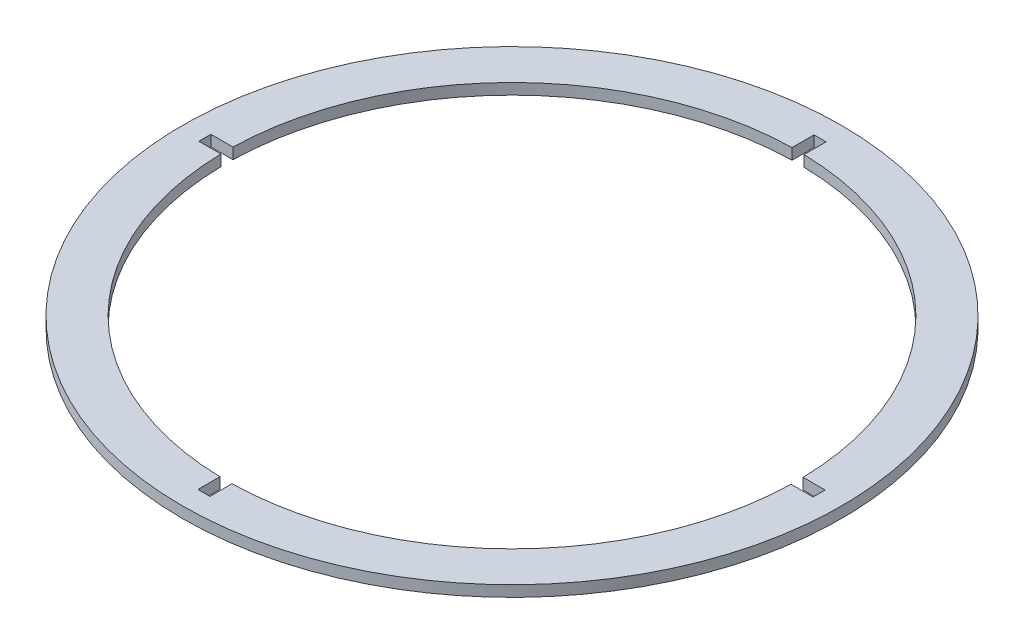
ISO-10303-21;
HEADER;
FILE_DESCRIPTION(('STEP AP214'),'2;1');
FILE_NAME('part.step','',(''),(''),'','','');
FILE_SCHEMA(('AUTOMOTIVE_DESIGN { 1 0 10303 214 1 1 1 1 }'));
ENDSEC;
DATA;
#1=APPLICATION_CONTEXT('core data for automotive mechanical design processes');
#2=APPLICATION_PROTOCOL_DEFINITION('international standard','automotive_design',2000,#1);
#3=PRODUCT_CONTEXT('',#1,'mechanical');
#4=PRODUCT('Part','Part','',(#3));
#5=PRODUCT_RELATED_PRODUCT_CATEGORY('part','',(#4));
#6=PRODUCT_DEFINITION_FORMATION('','',#4);
#7=PRODUCT_DEFINITION_CONTEXT('part definition',#1,'design');
#8=PRODUCT_DEFINITION('design','',#6,#7);
#9=PRODUCT_DEFINITION_SHAPE('','',#8);
#10=(LENGTH_UNIT() NAMED_UNIT(*) SI_UNIT(.MILLI.,.METRE.));
#11=(NAMED_UNIT(*) PLANE_ANGLE_UNIT() SI_UNIT($,.RADIAN.));
#12=(NAMED_UNIT(*) SI_UNIT($,.STERADIAN.) SOLID_ANGLE_UNIT());
#13=UNCERTAINTY_MEASURE_WITH_UNIT(LENGTH_MEASURE(1.E-05),#10,'distance_accuracy_value','');
#14=(GEOMETRIC_REPRESENTATION_CONTEXT(3) GLOBAL_UNCERTAINTY_ASSIGNED_CONTEXT((#13)) GLOBAL_UNIT_ASSIGNED_CONTEXT((#10,
#11,#12)) REPRESENTATION_CONTEXT('',''));
#15=CARTESIAN_POINT('',(0.,0.,0.));
#16=DIRECTION('',(0.,0.,1.));
#17=DIRECTION('',(1.,0.,0.));
#18=AXIS2_PLACEMENT_3D('',#15,#16,#17);
#19=CARTESIAN_POINT('',(0.,2.5,0.));
#20=DIRECTION('',(0.,1.,0.));
#21=DIRECTION('',(0.,0.,1.));
#22=AXIS2_PLACEMENT_3D('',#19,#20,#21);
#23=PLANE('',#22);
#24=CARTESIAN_POINT('',(0.,2.5,0.));
#25=DIRECTION('',(0.,1.,0.));
#26=DIRECTION('',(0.,0.,1.));
#27=AXIS2_PLACEMENT_3D('',#24,#25,#26);
#28=CIRCLE('',#27,150.);
#29=CARTESIAN_POINT('',(0.,2.5,150.));
#30=VERTEX_POINT('',#29);
#31=EDGE_CURVE('E11',#30,#30,#28,.T.);
#32=ORIENTED_EDGE('',*,*,#31,.T.);
#33=EDGE_LOOP('',(#32));
#34=FACE_BOUND('',#33,.T.);
#35=DIRECTION('',(0.,0.,-1.));
#36=VECTOR('',#35,1.);
#37=CARTESIAN_POINT('',(2.97500000000147,2.5,-140.));
#38=LINE('',#37,#36);
#39=CARTESIAN_POINT('',(2.97500000000136,2.5,-129.9659546766));
#40=VERTEX_POINT('',#39);
#41=CARTESIAN_POINT('',(2.97500000000147,2.5,-140.));
#42=VERTEX_POINT('',#41);
#43=EDGE_CURVE('E154',#40,#42,#38,.T.);
#44=ORIENTED_EDGE('',*,*,#43,.F.);
#45=CARTESIAN_POINT('',(0.,2.5,0.));
#46=DIRECTION('',(0.,1.,0.));
#47=DIRECTION('',(0.,0.,1.));
#48=AXIS2_PLACEMENT_3D('',#45,#46,#47);
#49=CIRCLE('',#48,130.);
#50=CARTESIAN_POINT('',(129.975476052215,2.5,-2.525));
#51=VERTEX_POINT('',#50);
#52=EDGE_CURVE('E146',#51,#40,#49,.T.);
#53=ORIENTED_EDGE('',*,*,#52,.F.);
#54=DIRECTION('',(-1.,0.,0.));
#55=VECTOR('',#54,1.);
#56=CARTESIAN_POINT('',(129.975476052215,2.5,-2.525));
#57=LINE('',#56,#55);
#58=CARTESIAN_POINT('',(140.,2.5,-2.525));
#59=VERTEX_POINT('',#58);
#60=EDGE_CURVE('E194',#59,#51,#57,.T.);
#61=ORIENTED_EDGE('',*,*,#60,.F.);
#62=DIRECTION('',(0.,0.,-1.));
#63=VECTOR('',#62,1.);
#64=CARTESIAN_POINT('',(140.,2.5,-2.525));
#65=LINE('',#64,#63);
#66=CARTESIAN_POINT('',(140.,2.5,2.975));
#67=VERTEX_POINT('',#66);
#68=EDGE_CURVE('E192',#67,#59,#65,.T.);
#69=ORIENTED_EDGE('',*,*,#68,.F.);
#70=DIRECTION('',(1.,0.,0.));
#71=VECTOR('',#70,1.);
#72=CARTESIAN_POINT('',(140.,2.5,2.975));
#73=LINE('',#72,#71);
#74=CARTESIAN_POINT('',(129.9659546766,2.5,2.975));
#75=VERTEX_POINT('',#74);
#76=EDGE_CURVE('E190',#75,#67,#73,.T.);
#77=ORIENTED_EDGE('',*,*,#76,.F.);
#78=CARTESIAN_POINT('',(0.,2.5,0.));
#79=DIRECTION('',(0.,1.,0.));
#80=DIRECTION('',(0.,0.,1.));
#81=AXIS2_PLACEMENT_3D('',#78,#79,#80);
#82=CIRCLE('',#81,130.);
#83=CARTESIAN_POINT('',(2.52499999999955,2.5,129.975476052215));
#84=VERTEX_POINT('',#83);
#85=EDGE_CURVE('E188',#84,#75,#82,.T.);
#86=ORIENTED_EDGE('',*,*,#85,.F.);
#87=DIRECTION('',(0.,0.,-1.));
#88=VECTOR('',#87,1.);
#89=CARTESIAN_POINT('',(2.52499999999955,2.5,129.975476052215));
#90=LINE('',#89,#88);
#91=CARTESIAN_POINT('',(2.52499999999951,2.5,140.));
#92=VERTEX_POINT('',#91);
#93=EDGE_CURVE('E186',#92,#84,#90,.T.);
#94=ORIENTED_EDGE('',*,*,#93,.F.);
#95=DIRECTION('',(1.,0.,0.));
#96=VECTOR('',#95,1.);
#97=CARTESIAN_POINT('',(2.52499999999951,2.5,140.));
#98=LINE('',#97,#96);
#99=CARTESIAN_POINT('',(-2.97500000000049,2.5,140.));
#100=VERTEX_POINT('',#99);
#101=EDGE_CURVE('E184',#100,#92,#98,.T.);
#102=ORIENTED_EDGE('',*,*,#101,.F.);
#103=DIRECTION('',(0.,0.,1.));
#104=VECTOR('',#103,1.);
#105=CARTESIAN_POINT('',(-2.97500000000049,2.5,140.));
#106=LINE('',#105,#104);
#107=CARTESIAN_POINT('',(-2.97500000000045,2.5,129.9659546766));
#108=VERTEX_POINT('',#107);
#109=EDGE_CURVE('E182',#108,#100,#106,.T.);
#110=ORIENTED_EDGE('',*,*,#109,.F.);
#111=CARTESIAN_POINT('',(0.,2.5,0.));
#112=DIRECTION('',(0.,1.,0.));
#113=DIRECTION('',(0.,0.,1.));
#114=AXIS2_PLACEMENT_3D('',#111,#112,#113);
#115=CIRCLE('',#114,130.);
#116=CARTESIAN_POINT('',(-129.975476052215,2.5,2.525));
#117=VERTEX_POINT('',#116);
#118=EDGE_CURVE('E180',#117,#108,#115,.T.);
#119=ORIENTED_EDGE('',*,*,#118,.F.);
#120=DIRECTION('',(1.,0.,0.));
#121=VECTOR('',#120,1.);
#122=CARTESIAN_POINT('',(-129.975476052215,2.5,2.52500000000002));
#123=LINE('',#122,#121);
#124=CARTESIAN_POINT('',(-140.,2.5,2.52499999999902));
#125=VERTEX_POINT('',#124);
#126=EDGE_CURVE('E178',#125,#117,#123,.T.);
#127=ORIENTED_EDGE('',*,*,#126,.F.);
#128=DIRECTION('',(0.,0.,1.));
#129=VECTOR('',#128,1.);
#130=CARTESIAN_POINT('',(-140.,2.5,2.52499999999902));
#131=LINE('',#130,#129);
#132=CARTESIAN_POINT('',(-140.,2.5,-2.97500000000098));
#133=VERTEX_POINT('',#132);
#134=EDGE_CURVE('E176',#133,#125,#131,.T.);
#135=ORIENTED_EDGE('',*,*,#134,.F.);
#136=DIRECTION('',(-1.,0.,0.));
#137=VECTOR('',#136,1.);
#138=CARTESIAN_POINT('',(-140.,2.5,-2.97500000000098));
#139=LINE('',#138,#137);
#140=CARTESIAN_POINT('',(-129.9659546766,2.5,-2.97500000000091));
#141=VERTEX_POINT('',#140);
#142=EDGE_CURVE('E174',#141,#133,#139,.T.);
#143=ORIENTED_EDGE('',*,*,#142,.F.);
#144=CARTESIAN_POINT('',(0.,2.5,0.));
#145=DIRECTION('',(0.,1.,0.));
#146=DIRECTION('',(0.,0.,1.));
#147=AXIS2_PLACEMENT_3D('',#144,#145,#146);
#148=CIRCLE('',#147,130.);
#149=CARTESIAN_POINT('',(-2.52499999999863,2.5,-129.975476052215));
#150=VERTEX_POINT('',#149);
#151=EDGE_CURVE('E172',#150,#141,#148,.T.);
#152=ORIENTED_EDGE('',*,*,#151,.F.);
#153=DIRECTION('',(0.,0.,1.));
#154=VECTOR('',#153,1.);
#155=CARTESIAN_POINT('',(-2.52499999999864,2.5,-129.975476052215));
#156=LINE('',#155,#154);
#157=CARTESIAN_POINT('',(-2.52499999999853,2.5,-140.));
#158=VERTEX_POINT('',#157);
#159=EDGE_CURVE('E168',#158,#150,#156,.T.);
#160=ORIENTED_EDGE('',*,*,#159,.F.);
#161=DIRECTION('',(-1.,0.,0.));
#162=VECTOR('',#161,1.);
#163=CARTESIAN_POINT('',(-2.52499999999853,2.5,-140.));
#164=LINE('',#163,#162);
#165=EDGE_CURVE('E166',#42,#158,#164,.T.);
#166=ORIENTED_EDGE('',*,*,#165,.F.);
#167=EDGE_LOOP('',(#44,#53,#61,#69,#77,#86,#94,#102,#110,#119,#127,#135,#143,#152,#160,#166));
#168=FACE_BOUND('',#167,.T.);
#169=ADVANCED_FACE('F33',(#34,#168),#23,.T.);
#170=CARTESIAN_POINT('',(0.,-2.5,0.));
#171=DIRECTION('',(0.,1.,0.));
#172=DIRECTION('',(0.,0.,1.));
#173=AXIS2_PLACEMENT_3D('',#170,#171,#172);
#174=PLANE('',#173);
#175=CARTESIAN_POINT('',(0.,-2.5,0.));
#176=DIRECTION('',(0.,1.,0.));
#177=DIRECTION('',(0.,0.,1.));
#178=AXIS2_PLACEMENT_3D('',#175,#176,#177);
#179=CIRCLE('',#178,150.);
#180=CARTESIAN_POINT('',(0.,-2.5,150.));
#181=VERTEX_POINT('',#180);
#182=EDGE_CURVE('E37',#181,#181,#179,.T.);
#183=ORIENTED_EDGE('',*,*,#182,.F.);
#184=EDGE_LOOP('',(#183));
#185=FACE_BOUND('',#184,.T.);
#186=CARTESIAN_POINT('',(0.,-2.5,0.));
#187=DIRECTION('',(0.,1.,0.));
#188=DIRECTION('',(0.,0.,1.));
#189=AXIS2_PLACEMENT_3D('',#186,#187,#188);
#190=CIRCLE('',#189,130.);
#191=CARTESIAN_POINT('',(129.975476052215,-2.5,-2.525));
#192=VERTEX_POINT('',#191);
#193=CARTESIAN_POINT('',(2.97500000000136,-2.5,-129.9659546766));
#194=VERTEX_POINT('',#193);
#195=EDGE_CURVE('E56',#192,#194,#190,.T.);
#196=ORIENTED_EDGE('',*,*,#195,.T.);
#197=DIRECTION('',(0.,0.,-1.));
#198=VECTOR('',#197,1.);
#199=CARTESIAN_POINT('',(2.97500000000147,-2.5,-140.));
#200=LINE('',#199,#198);
#201=CARTESIAN_POINT('',(2.97500000000147,-2.5,-140.));
#202=VERTEX_POINT('',#201);
#203=EDGE_CURVE('E161',#194,#202,#200,.T.);
#204=ORIENTED_EDGE('',*,*,#203,.T.);
#205=DIRECTION('',(-1.,0.,0.));
#206=VECTOR('',#205,1.);
#207=CARTESIAN_POINT('',(-2.52499999999853,-2.5,-140.));
#208=LINE('',#207,#206);
#209=CARTESIAN_POINT('',(-2.52499999999853,-2.5,-140.));
#210=VERTEX_POINT('',#209);
#211=EDGE_CURVE('E198',#202,#210,#208,.T.);
#212=ORIENTED_EDGE('',*,*,#211,.T.);
#213=DIRECTION('',(0.,0.,1.));
#214=VECTOR('',#213,1.);
#215=CARTESIAN_POINT('',(-2.52499999999864,-2.5,-129.975476052215));
#216=LINE('',#215,#214);
#217=CARTESIAN_POINT('',(-2.52499999999863,-2.5,-129.975476052215));
#218=VERTEX_POINT('',#217);
#219=EDGE_CURVE('E201',#210,#218,#216,.T.);
#220=ORIENTED_EDGE('',*,*,#219,.T.);
#221=CARTESIAN_POINT('',(0.,-2.5,0.));
#222=DIRECTION('',(0.,1.,0.));
#223=DIRECTION('',(0.,0.,1.));
#224=AXIS2_PLACEMENT_3D('',#221,#222,#223);
#225=CIRCLE('',#224,130.);
#226=CARTESIAN_POINT('',(-129.9659546766,-2.5,-2.97500000000091));
#227=VERTEX_POINT('',#226);
#228=EDGE_CURVE('E204',#218,#227,#225,.T.);
#229=ORIENTED_EDGE('',*,*,#228,.T.);
#230=DIRECTION('',(-1.,0.,0.));
#231=VECTOR('',#230,1.);
#232=CARTESIAN_POINT('',(-140.,-2.5,-2.97500000000098));
#233=LINE('',#232,#231);
#234=CARTESIAN_POINT('',(-140.,-2.5,-2.97500000000098));
#235=VERTEX_POINT('',#234);
#236=EDGE_CURVE('E207',#227,#235,#233,.T.);
#237=ORIENTED_EDGE('',*,*,#236,.T.);
#238=DIRECTION('',(0.,0.,1.));
#239=VECTOR('',#238,1.);
#240=CARTESIAN_POINT('',(-140.,-2.5,2.52499999999902));
#241=LINE('',#240,#239);
#242=CARTESIAN_POINT('',(-140.,-2.5,2.52499999999902));
#243=VERTEX_POINT('',#242);
#244=EDGE_CURVE('E210',#235,#243,#241,.T.);
#245=ORIENTED_EDGE('',*,*,#244,.T.);
#246=DIRECTION('',(1.,0.,0.));
#247=VECTOR('',#246,1.);
#248=CARTESIAN_POINT('',(-129.975476052215,-2.5,2.52500000000002));
#249=LINE('',#248,#247);
#250=CARTESIAN_POINT('',(-129.975476052215,-2.5,2.525));
#251=VERTEX_POINT('',#250);
#252=EDGE_CURVE('E213',#243,#251,#249,.T.);
#253=ORIENTED_EDGE('',*,*,#252,.T.);
#254=CARTESIAN_POINT('',(0.,-2.5,0.));
#255=DIRECTION('',(0.,1.,0.));
#256=DIRECTION('',(0.,0.,1.));
#257=AXIS2_PLACEMENT_3D('',#254,#255,#256);
#258=CIRCLE('',#257,130.);
#259=CARTESIAN_POINT('',(-2.97500000000045,-2.5,129.9659546766));
#260=VERTEX_POINT('',#259);
#261=EDGE_CURVE('E216',#251,#260,#258,.T.);
#262=ORIENTED_EDGE('',*,*,#261,.T.);
#263=DIRECTION('',(0.,0.,1.));
#264=VECTOR('',#263,1.);
#265=CARTESIAN_POINT('',(-2.97500000000049,-2.5,140.));
#266=LINE('',#265,#264);
#267=CARTESIAN_POINT('',(-2.97500000000049,-2.5,140.));
#268=VERTEX_POINT('',#267);
#269=EDGE_CURVE('E219',#260,#268,#266,.T.);
#270=ORIENTED_EDGE('',*,*,#269,.T.);
#271=DIRECTION('',(1.,0.,0.));
#272=VECTOR('',#271,1.);
#273=CARTESIAN_POINT('',(2.52499999999951,-2.5,140.));
#274=LINE('',#273,#272);
#275=CARTESIAN_POINT('',(2.52499999999951,-2.5,140.));
#276=VERTEX_POINT('',#275);
#277=EDGE_CURVE('E222',#268,#276,#274,.T.);
#278=ORIENTED_EDGE('',*,*,#277,.T.);
#279=DIRECTION('',(0.,0.,-1.));
#280=VECTOR('',#279,1.);
#281=CARTESIAN_POINT('',(2.52499999999955,-2.5,129.975476052215));
#282=LINE('',#281,#280);
#283=CARTESIAN_POINT('',(2.52499999999955,-2.5,129.975476052215));
#284=VERTEX_POINT('',#283);
#285=EDGE_CURVE('E225',#276,#284,#282,.T.);
#286=ORIENTED_EDGE('',*,*,#285,.T.);
#287=CARTESIAN_POINT('',(0.,-2.5,0.));
#288=DIRECTION('',(0.,1.,0.));
#289=DIRECTION('',(0.,0.,1.));
#290=AXIS2_PLACEMENT_3D('',#287,#288,#289);
#291=CIRCLE('',#290,130.);
#292=CARTESIAN_POINT('',(129.9659546766,-2.5,2.975));
#293=VERTEX_POINT('',#292);
#294=EDGE_CURVE('E228',#284,#293,#291,.T.);
#295=ORIENTED_EDGE('',*,*,#294,.T.);
#296=DIRECTION('',(1.,0.,0.));
#297=VECTOR('',#296,1.);
#298=CARTESIAN_POINT('',(140.,-2.5,2.975));
#299=LINE('',#298,#297);
#300=CARTESIAN_POINT('',(140.,-2.5,2.975));
#301=VERTEX_POINT('',#300);
#302=EDGE_CURVE('E231',#293,#301,#299,.T.);
#303=ORIENTED_EDGE('',*,*,#302,.T.);
#304=DIRECTION('',(0.,0.,-1.));
#305=VECTOR('',#304,1.);
#306=CARTESIAN_POINT('',(140.,-2.5,-2.525));
#307=LINE('',#306,#305);
#308=CARTESIAN_POINT('',(140.,-2.5,-2.525));
#309=VERTEX_POINT('',#308);
#310=EDGE_CURVE('E234',#301,#309,#307,.T.);
#311=ORIENTED_EDGE('',*,*,#310,.T.);
#312=DIRECTION('',(-1.,0.,0.));
#313=VECTOR('',#312,1.);
#314=CARTESIAN_POINT('',(129.975476052215,-2.5,-2.525));
#315=LINE('',#314,#313);
#316=EDGE_CURVE('E155',#309,#192,#315,.T.);
#317=ORIENTED_EDGE('',*,*,#316,.T.);
#318=EDGE_LOOP('',(#196,#204,#212,#220,#229,#237,#245,#253,#262,#270,#278,#286,#295,#303,#311,#317));
#319=FACE_BOUND('',#318,.T.);
#320=ADVANCED_FACE('F271',(#185,#319),#174,.F.);
#321=CARTESIAN_POINT('',(0.,2.5,0.));
#322=DIRECTION('',(0.,-1.,0.));
#323=DIRECTION('',(0.,0.,-1.));
#324=AXIS2_PLACEMENT_3D('',#321,#322,#323);
#325=CYLINDRICAL_SURFACE('',#324,150.);
#326=ORIENTED_EDGE('',*,*,#31,.F.);
#327=EDGE_LOOP('',(#326));
#328=FACE_BOUND('',#327,.T.);
#329=ORIENTED_EDGE('',*,*,#182,.T.);
#330=EDGE_LOOP('',(#329));
#331=FACE_BOUND('',#330,.T.);
#332=ADVANCED_FACE('F35',(#328,#331),#325,.T.);
#333=CARTESIAN_POINT('',(0.,2.5,0.));
#334=DIRECTION('',(0.,-1.,0.));
#335=DIRECTION('',(0.,0.,-1.));
#336=AXIS2_PLACEMENT_3D('',#333,#334,#335);
#337=CYLINDRICAL_SURFACE('',#336,130.);
#338=ORIENTED_EDGE('',*,*,#195,.F.);
#339=DIRECTION('',(0.,-1.,0.));
#340=VECTOR('',#339,1.);
#341=CARTESIAN_POINT('',(129.975476052215,2.5,-2.525));
#342=LINE('',#341,#340);
#343=EDGE_CURVE('E150',#51,#192,#342,.T.);
#344=ORIENTED_EDGE('',*,*,#343,.F.);
#345=ORIENTED_EDGE('',*,*,#52,.T.);
#346=DIRECTION('',(0.,-1.,0.));
#347=VECTOR('',#346,1.);
#348=CARTESIAN_POINT('',(2.97500000000136,2.5,-129.9659546766));
#349=LINE('',#348,#347);
#350=EDGE_CURVE('E149',#40,#194,#349,.T.);
#351=ORIENTED_EDGE('',*,*,#350,.T.);
#352=EDGE_LOOP('',(#338,#344,#345,#351));
#353=FACE_BOUND('',#352,.T.);
#354=ADVANCED_FACE('F148',(#353),#337,.F.);
#355=CARTESIAN_POINT('',(2.97500000000147,2.5,-140.));
#356=DIRECTION('',(-1.,0.,0.));
#357=DIRECTION('',(0.,0.,1.));
#358=AXIS2_PLACEMENT_3D('',#355,#356,#357);
#359=PLANE('',#358);
#360=ORIENTED_EDGE('',*,*,#203,.F.);
#361=ORIENTED_EDGE('',*,*,#350,.F.);
#362=ORIENTED_EDGE('',*,*,#43,.T.);
#363=DIRECTION('',(0.,-1.,0.));
#364=VECTOR('',#363,1.);
#365=CARTESIAN_POINT('',(2.97500000000147,2.5,-140.));
#366=LINE('',#365,#364);
#367=EDGE_CURVE('E162',#42,#202,#366,.T.);
#368=ORIENTED_EDGE('',*,*,#367,.T.);
#369=EDGE_LOOP('',(#360,#361,#362,#368));
#370=FACE_BOUND('',#369,.T.);
#371=ADVANCED_FACE('F158',(#370),#359,.T.);
#372=CARTESIAN_POINT('',(-2.52499999999853,2.5,-140.));
#373=DIRECTION('',(0.,0.,1.));
#374=DIRECTION('',(1.,0.,0.));
#375=AXIS2_PLACEMENT_3D('',#372,#373,#374);
#376=PLANE('',#375);
#377=ORIENTED_EDGE('',*,*,#211,.F.);
#378=ORIENTED_EDGE('',*,*,#367,.F.);
#379=ORIENTED_EDGE('',*,*,#165,.T.);
#380=DIRECTION('',(0.,-1.,0.));
#381=VECTOR('',#380,1.);
#382=CARTESIAN_POINT('',(-2.52499999999853,2.5,-140.));
#383=LINE('',#382,#381);
#384=EDGE_CURVE('E263',#158,#210,#383,.T.);
#385=ORIENTED_EDGE('',*,*,#384,.T.);
#386=EDGE_LOOP('',(#377,#378,#379,#385));
#387=FACE_BOUND('',#386,.T.);
#388=ADVANCED_FACE('F267',(#387),#376,.T.);
#389=CARTESIAN_POINT('',(-2.52499999999864,2.5,-129.975476052215));
#390=DIRECTION('',(1.,0.,0.));
#391=DIRECTION('',(0.,0.,-1.));
#392=AXIS2_PLACEMENT_3D('',#389,#390,#391);
#393=PLANE('',#392);
#394=ORIENTED_EDGE('',*,*,#219,.F.);
#395=ORIENTED_EDGE('',*,*,#384,.F.);
#396=ORIENTED_EDGE('',*,*,#159,.T.);
#397=DIRECTION('',(0.,-1.,0.));
#398=VECTOR('',#397,1.);
#399=CARTESIAN_POINT('',(-2.52499999999863,2.5,-129.975476052215));
#400=LINE('',#399,#398);
#401=EDGE_CURVE('E261',#150,#218,#400,.T.);
#402=ORIENTED_EDGE('',*,*,#401,.T.);
#403=EDGE_LOOP('',(#394,#395,#396,#402));
#404=FACE_BOUND('',#403,.T.);
#405=ADVANCED_FACE('F329',(#404),#393,.T.);
#406=CARTESIAN_POINT('',(0.,2.5,0.));
#407=DIRECTION('',(0.,-1.,0.));
#408=DIRECTION('',(0.,0.,-1.));
#409=AXIS2_PLACEMENT_3D('',#406,#407,#408);
#410=CYLINDRICAL_SURFACE('',#409,130.);
#411=ORIENTED_EDGE('',*,*,#228,.F.);
#412=ORIENTED_EDGE('',*,*,#401,.F.);
#413=ORIENTED_EDGE('',*,*,#151,.T.);
#414=DIRECTION('',(0.,-1.,0.));
#415=VECTOR('',#414,1.);
#416=CARTESIAN_POINT('',(-129.9659546766,2.5,-2.97500000000091));
#417=LINE('',#416,#415);
#418=EDGE_CURVE('E259',#141,#227,#417,.T.);
#419=ORIENTED_EDGE('',*,*,#418,.T.);
#420=EDGE_LOOP('',(#411,#412,#413,#419));
#421=FACE_BOUND('',#420,.T.);
#422=ADVANCED_FACE('F326',(#421),#410,.F.);
#423=CARTESIAN_POINT('',(-140.,2.5,-2.97500000000098));
#424=DIRECTION('',(0.,0.,1.));
#425=DIRECTION('',(1.,0.,0.));
#426=AXIS2_PLACEMENT_3D('',#423,#424,#425);
#427=PLANE('',#426);
#428=ORIENTED_EDGE('',*,*,#236,.F.);
#429=ORIENTED_EDGE('',*,*,#418,.F.);
#430=ORIENTED_EDGE('',*,*,#142,.T.);
#431=DIRECTION('',(0.,-1.,0.));
#432=VECTOR('',#431,1.);
#433=CARTESIAN_POINT('',(-140.,2.5,-2.97500000000098));
#434=LINE('',#433,#432);
#435=EDGE_CURVE('E257',#133,#235,#434,.T.);
#436=ORIENTED_EDGE('',*,*,#435,.T.);
#437=EDGE_LOOP('',(#428,#429,#430,#436));
#438=FACE_BOUND('',#437,.T.);
#439=ADVANCED_FACE('F323',(#438),#427,.T.);
#440=CARTESIAN_POINT('',(-140.,2.5,2.52499999999902));
#441=DIRECTION('',(1.,0.,0.));
#442=DIRECTION('',(0.,0.,-1.));
#443=AXIS2_PLACEMENT_3D('',#440,#441,#442);
#444=PLANE('',#443);
#445=ORIENTED_EDGE('',*,*,#244,.F.);
#446=ORIENTED_EDGE('',*,*,#435,.F.);
#447=ORIENTED_EDGE('',*,*,#134,.T.);
#448=DIRECTION('',(0.,-1.,0.));
#449=VECTOR('',#448,1.);
#450=CARTESIAN_POINT('',(-140.,2.5,2.52499999999902));
#451=LINE('',#450,#449);
#452=EDGE_CURVE('E255',#125,#243,#451,.T.);
#453=ORIENTED_EDGE('',*,*,#452,.T.);
#454=EDGE_LOOP('',(#445,#446,#447,#453));
#455=FACE_BOUND('',#454,.T.);
#456=ADVANCED_FACE('F316',(#455),#444,.T.);
#457=CARTESIAN_POINT('',(-129.975476052215,2.5,2.52500000000002));
#458=DIRECTION('',(0.,0.,-1.));
#459=DIRECTION('',(-1.,0.,0.));
#460=AXIS2_PLACEMENT_3D('',#457,#458,#459);
#461=PLANE('',#460);
#462=ORIENTED_EDGE('',*,*,#252,.F.);
#463=ORIENTED_EDGE('',*,*,#452,.F.);
#464=ORIENTED_EDGE('',*,*,#126,.T.);
#465=DIRECTION('',(0.,-1.,0.));
#466=VECTOR('',#465,1.);
#467=CARTESIAN_POINT('',(-129.975476052215,2.5,2.525));
#468=LINE('',#467,#466);
#469=EDGE_CURVE('E253',#117,#251,#468,.T.);
#470=ORIENTED_EDGE('',*,*,#469,.T.);
#471=EDGE_LOOP('',(#462,#463,#464,#470));
#472=FACE_BOUND('',#471,.T.);
#473=ADVANCED_FACE('F312',(#472),#461,.T.);
#474=CARTESIAN_POINT('',(0.,2.5,0.));
#475=DIRECTION('',(0.,-1.,0.));
#476=DIRECTION('',(0.,0.,-1.));
#477=AXIS2_PLACEMENT_3D('',#474,#475,#476);
#478=CYLINDRICAL_SURFACE('',#477,130.);
#479=ORIENTED_EDGE('',*,*,#261,.F.);
#480=ORIENTED_EDGE('',*,*,#469,.F.);
#481=ORIENTED_EDGE('',*,*,#118,.T.);
#482=DIRECTION('',(0.,-1.,0.));
#483=VECTOR('',#482,1.);
#484=CARTESIAN_POINT('',(-2.97500000000045,2.5,129.9659546766));
#485=LINE('',#484,#483);
#486=EDGE_CURVE('E251',#108,#260,#485,.T.);
#487=ORIENTED_EDGE('',*,*,#486,.T.);
#488=EDGE_LOOP('',(#479,#480,#481,#487));
#489=FACE_BOUND('',#488,.T.);
#490=ADVANCED_FACE('F309',(#489),#478,.F.);
#491=CARTESIAN_POINT('',(-2.97500000000049,2.5,140.));
#492=DIRECTION('',(1.,0.,0.));
#493=DIRECTION('',(0.,0.,-1.));
#494=AXIS2_PLACEMENT_3D('',#491,#492,#493);
#495=PLANE('',#494);
#496=ORIENTED_EDGE('',*,*,#269,.F.);
#497=ORIENTED_EDGE('',*,*,#486,.F.);
#498=ORIENTED_EDGE('',*,*,#109,.T.);
#499=DIRECTION('',(0.,-1.,0.));
#500=VECTOR('',#499,1.);
#501=CARTESIAN_POINT('',(-2.97500000000049,2.5,140.));
#502=LINE('',#501,#500);
#503=EDGE_CURVE('E249',#100,#268,#502,.T.);
#504=ORIENTED_EDGE('',*,*,#503,.T.);
#505=EDGE_LOOP('',(#496,#497,#498,#504));
#506=FACE_BOUND('',#505,.T.);
#507=ADVANCED_FACE('F301',(#506),#495,.T.);
#508=CARTESIAN_POINT('',(2.52499999999951,2.5,140.));
#509=DIRECTION('',(0.,0.,-1.));
#510=DIRECTION('',(-1.,0.,0.));
#511=AXIS2_PLACEMENT_3D('',#508,#509,#510);
#512=PLANE('',#511);
#513=ORIENTED_EDGE('',*,*,#277,.F.);
#514=ORIENTED_EDGE('',*,*,#503,.F.);
#515=ORIENTED_EDGE('',*,*,#101,.T.);
#516=DIRECTION('',(0.,-1.,0.));
#517=VECTOR('',#516,1.);
#518=CARTESIAN_POINT('',(2.52499999999951,2.5,140.));
#519=LINE('',#518,#517);
#520=EDGE_CURVE('E247',#92,#276,#519,.T.);
#521=ORIENTED_EDGE('',*,*,#520,.T.);
#522=EDGE_LOOP('',(#513,#514,#515,#521));
#523=FACE_BOUND('',#522,.T.);
#524=ADVANCED_FACE('F297',(#523),#512,.T.);
#525=CARTESIAN_POINT('',(2.52499999999955,2.5,129.975476052215));
#526=DIRECTION('',(-1.,0.,0.));
#527=DIRECTION('',(0.,0.,1.));
#528=AXIS2_PLACEMENT_3D('',#525,#526,#527);
#529=PLANE('',#528);
#530=ORIENTED_EDGE('',*,*,#285,.F.);
#531=ORIENTED_EDGE('',*,*,#520,.F.);
#532=ORIENTED_EDGE('',*,*,#93,.T.);
#533=DIRECTION('',(0.,-1.,0.));
#534=VECTOR('',#533,1.);
#535=CARTESIAN_POINT('',(2.52499999999955,2.5,129.975476052215));
#536=LINE('',#535,#534);
#537=EDGE_CURVE('E245',#84,#284,#536,.T.);
#538=ORIENTED_EDGE('',*,*,#537,.T.);
#539=EDGE_LOOP('',(#530,#531,#532,#538));
#540=FACE_BOUND('',#539,.T.);
#541=ADVANCED_FACE('F294',(#540),#529,.T.);
#542=CARTESIAN_POINT('',(0.,2.5,0.));
#543=DIRECTION('',(0.,-1.,0.));
#544=DIRECTION('',(0.,0.,-1.));
#545=AXIS2_PLACEMENT_3D('',#542,#543,#544);
#546=CYLINDRICAL_SURFACE('',#545,130.);
#547=ORIENTED_EDGE('',*,*,#294,.F.);
#548=ORIENTED_EDGE('',*,*,#537,.F.);
#549=ORIENTED_EDGE('',*,*,#85,.T.);
#550=DIRECTION('',(0.,-1.,0.));
#551=VECTOR('',#550,1.);
#552=CARTESIAN_POINT('',(129.9659546766,2.5,2.975));
#553=LINE('',#552,#551);
#554=EDGE_CURVE('E243',#75,#293,#553,.T.);
#555=ORIENTED_EDGE('',*,*,#554,.T.);
#556=EDGE_LOOP('',(#547,#548,#549,#555));
#557=FACE_BOUND('',#556,.T.);
#558=ADVANCED_FACE('F286',(#557),#546,.F.);
#559=CARTESIAN_POINT('',(140.,2.5,2.975));
#560=DIRECTION('',(0.,0.,-1.));
#561=DIRECTION('',(-1.,0.,0.));
#562=AXIS2_PLACEMENT_3D('',#559,#560,#561);
#563=PLANE('',#562);
#564=ORIENTED_EDGE('',*,*,#302,.F.);
#565=ORIENTED_EDGE('',*,*,#554,.F.);
#566=ORIENTED_EDGE('',*,*,#76,.T.);
#567=DIRECTION('',(0.,-1.,0.));
#568=VECTOR('',#567,1.);
#569=CARTESIAN_POINT('',(140.,2.5,2.975));
#570=LINE('',#569,#568);
#571=EDGE_CURVE('E241',#67,#301,#570,.T.);
#572=ORIENTED_EDGE('',*,*,#571,.T.);
#573=EDGE_LOOP('',(#564,#565,#566,#572));
#574=FACE_BOUND('',#573,.T.);
#575=ADVANCED_FACE('F282',(#574),#563,.T.);
#576=CARTESIAN_POINT('',(140.,2.5,-2.525));
#577=DIRECTION('',(-1.,0.,0.));
#578=DIRECTION('',(0.,0.,1.));
#579=AXIS2_PLACEMENT_3D('',#576,#577,#578);
#580=PLANE('',#579);
#581=ORIENTED_EDGE('',*,*,#310,.F.);
#582=ORIENTED_EDGE('',*,*,#571,.F.);
#583=ORIENTED_EDGE('',*,*,#68,.T.);
#584=DIRECTION('',(0.,-1.,0.));
#585=VECTOR('',#584,1.);
#586=CARTESIAN_POINT('',(140.,2.5,-2.525));
#587=LINE('',#586,#585);
#588=EDGE_CURVE('E48',#59,#309,#587,.T.);
#589=ORIENTED_EDGE('',*,*,#588,.T.);
#590=EDGE_LOOP('',(#581,#582,#583,#589));
#591=FACE_BOUND('',#590,.T.);
#592=ADVANCED_FACE('F279',(#591),#580,.T.);
#593=CARTESIAN_POINT('',(129.975476052215,2.5,-2.525));
#594=DIRECTION('',(0.,0.,1.));
#595=DIRECTION('',(1.,0.,0.));
#596=AXIS2_PLACEMENT_3D('',#593,#594,#595);
#597=PLANE('',#596);
#598=ORIENTED_EDGE('',*,*,#316,.F.);
#599=ORIENTED_EDGE('',*,*,#588,.F.);
#600=ORIENTED_EDGE('',*,*,#60,.T.);
#601=ORIENTED_EDGE('',*,*,#343,.T.);
#602=EDGE_LOOP('',(#598,#599,#600,#601));
#603=FACE_BOUND('',#602,.T.);
#604=ADVANCED_FACE('F273',(#603),#597,.T.);
#605=CLOSED_SHELL('',(#169,#320,#332,#354,#371,#388,#405,#422,#439,#456,#473,#490,#507,#524,
#541,#558,#575,#592,#604));
#606=MANIFOLD_SOLID_BREP('B2',#605);
#607=ADVANCED_BREP_SHAPE_REPRESENTATION('',(#18,#606),#14);
#608=SHAPE_DEFINITION_REPRESENTATION(#9,#607);
ENDSEC;
END-ISO-10303-21;
